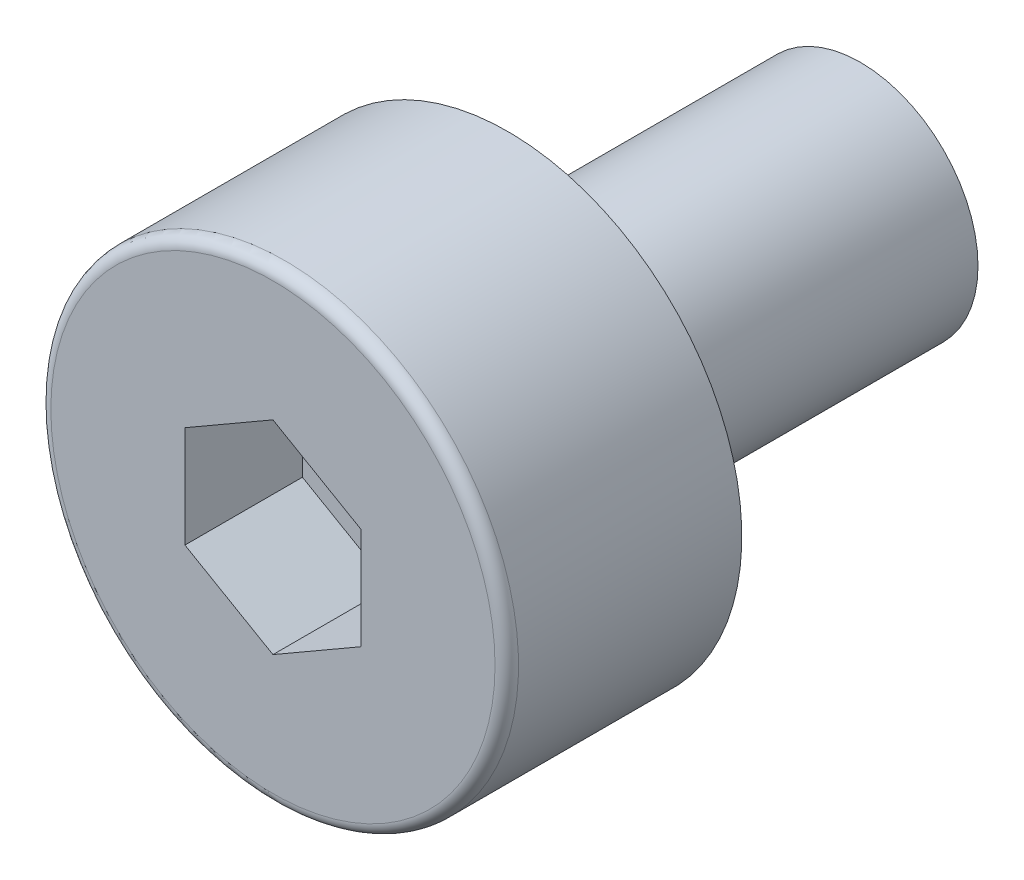
ISO-10303-21;
HEADER;
FILE_DESCRIPTION(('STEP AP214'),'2;1');
FILE_NAME('part.step','',(''),(''),'','','');
FILE_SCHEMA(('AUTOMOTIVE_DESIGN { 1 0 10303 214 1 1 1 1 }'));
ENDSEC;
DATA;
#1=APPLICATION_CONTEXT('core data for automotive mechanical design processes');
#2=APPLICATION_PROTOCOL_DEFINITION('international standard','automotive_design',2000,#1);
#3=PRODUCT_CONTEXT('',#1,'mechanical');
#4=PRODUCT('Part','Part','',(#3));
#5=PRODUCT_RELATED_PRODUCT_CATEGORY('part','',(#4));
#6=PRODUCT_DEFINITION_FORMATION('','',#4);
#7=PRODUCT_DEFINITION_CONTEXT('part definition',#1,'design');
#8=PRODUCT_DEFINITION('design','',#6,#7);
#9=PRODUCT_DEFINITION_SHAPE('','',#8);
#10=(LENGTH_UNIT() NAMED_UNIT(*) SI_UNIT(.MILLI.,.METRE.));
#11=(NAMED_UNIT(*) PLANE_ANGLE_UNIT() SI_UNIT($,.RADIAN.));
#12=(NAMED_UNIT(*) SI_UNIT($,.STERADIAN.) SOLID_ANGLE_UNIT());
#13=UNCERTAINTY_MEASURE_WITH_UNIT(LENGTH_MEASURE(1.E-05),#10,'distance_accuracy_value','');
#14=(GEOMETRIC_REPRESENTATION_CONTEXT(3) GLOBAL_UNCERTAINTY_ASSIGNED_CONTEXT((#13)) GLOBAL_UNIT_ASSIGNED_CONTEXT((#10,
#11,#12)) REPRESENTATION_CONTEXT('',''));
#15=CARTESIAN_POINT('',(0.,0.,0.));
#16=DIRECTION('',(0.,0.,1.));
#17=DIRECTION('',(1.,0.,0.));
#18=AXIS2_PLACEMENT_3D('',#15,#16,#17);
#19=CARTESIAN_POINT('',(0.,0.,1.));
#20=DIRECTION('',(0.,0.,1.));
#21=DIRECTION('',(1.,0.,0.));
#22=AXIS2_PLACEMENT_3D('',#19,#20,#21);
#23=PLANE('',#22);
#24=DIRECTION('',(-0.866025403784439,-0.5,0.));
#25=VECTOR('',#24,1.);
#26=CARTESIAN_POINT('',(0.,0.865000000000001,1.));
#27=LINE('',#26,#25);
#28=CARTESIAN_POINT('',(0.,0.865000000000001,1.));
#29=VERTEX_POINT('',#28);
#30=CARTESIAN_POINT('',(-0.749111974273539,0.4325,1.));
#31=VERTEX_POINT('',#30);
#32=EDGE_CURVE('E60',#29,#31,#27,.T.);
#33=ORIENTED_EDGE('',*,*,#32,.T.);
#34=DIRECTION('',(0.,1.,0.));
#35=VECTOR('',#34,1.);
#36=CARTESIAN_POINT('',(-0.749111974273539,0.4325,1.));
#37=LINE('',#36,#35);
#38=CARTESIAN_POINT('',(-0.749111974273539,-0.4325,1.));
#39=VERTEX_POINT('',#38);
#40=EDGE_CURVE('E62',#31,#39,#37,.F.);
#41=ORIENTED_EDGE('',*,*,#40,.T.);
#42=DIRECTION('',(0.866025403784439,-0.5,0.));
#43=VECTOR('',#42,1.);
#44=CARTESIAN_POINT('',(-0.749111974273539,-0.4325,1.));
#45=LINE('',#44,#43);
#46=CARTESIAN_POINT('',(0.,-0.865,1.));
#47=VERTEX_POINT('',#46);
#48=EDGE_CURVE('E64',#39,#47,#45,.T.);
#49=ORIENTED_EDGE('',*,*,#48,.T.);
#50=DIRECTION('',(0.866025403784438,0.5,0.));
#51=VECTOR('',#50,1.);
#52=CARTESIAN_POINT('',(0.,-0.865,1.));
#53=LINE('',#52,#51);
#54=CARTESIAN_POINT('',(0.749111974273539,-0.4325,1.));
#55=VERTEX_POINT('',#54);
#56=EDGE_CURVE('E297',#47,#55,#53,.T.);
#57=ORIENTED_EDGE('',*,*,#56,.T.);
#58=DIRECTION('',(0.,1.,0.));
#59=VECTOR('',#58,1.);
#60=CARTESIAN_POINT('',(0.749111974273539,-0.4325,1.));
#61=LINE('',#60,#59);
#62=CARTESIAN_POINT('',(0.749111974273539,0.432500000000001,1.));
#63=VERTEX_POINT('',#62);
#64=EDGE_CURVE('E292',#55,#63,#61,.T.);
#65=ORIENTED_EDGE('',*,*,#64,.T.);
#66=DIRECTION('',(-0.866025403784439,0.5,0.));
#67=VECTOR('',#66,1.);
#68=CARTESIAN_POINT('',(0.749111974273539,0.432500000000001,1.));
#69=LINE('',#68,#67);
#70=EDGE_CURVE('E287',#63,#29,#69,.T.);
#71=ORIENTED_EDGE('',*,*,#70,.T.);
#72=EDGE_LOOP('',(#33,#41,#49,#57,#65,#71));
#73=FACE_BOUND('',#72,.T.);
#74=ADVANCED_FACE('F17',(#73),#23,.T.);
#75=CARTESIAN_POINT('',(-0.749111974273539,-0.4325,1.));
#76=DIRECTION('',(-0.5,-0.866025403784439,0.));
#77=DIRECTION('',(0.866025403784439,-0.5,0.));
#78=AXIS2_PLACEMENT_3D('',#75,#76,#77);
#79=PLANE('',#78);
#80=DIRECTION('',(0.,0.,1.));
#81=VECTOR('',#80,1.);
#82=CARTESIAN_POINT('',(0.,-0.865,1.));
#83=LINE('',#82,#81);
#84=CARTESIAN_POINT('',(0.,-0.865,2.));
#85=VERTEX_POINT('',#84);
#86=EDGE_CURVE('E79',#85,#47,#83,.F.);
#87=ORIENTED_EDGE('',*,*,#86,.T.);
#88=ORIENTED_EDGE('',*,*,#48,.F.);
#89=DIRECTION('',(0.,0.,1.));
#90=VECTOR('',#89,1.);
#91=CARTESIAN_POINT('',(-0.749111974273539,-0.4325,1.));
#92=LINE('',#91,#90);
#93=CARTESIAN_POINT('',(-0.749111974273539,-0.4325,2.));
#94=VERTEX_POINT('',#93);
#95=EDGE_CURVE('E70',#39,#94,#92,.T.);
#96=ORIENTED_EDGE('',*,*,#95,.T.);
#97=DIRECTION('',(-0.866025403784439,0.5,0.));
#98=VECTOR('',#97,1.);
#99=CARTESIAN_POINT('',(0.,-0.865,2.));
#100=LINE('',#99,#98);
#101=EDGE_CURVE('E146',#85,#94,#100,.T.);
#102=ORIENTED_EDGE('',*,*,#101,.F.);
#103=EDGE_LOOP('',(#87,#88,#96,#102));
#104=FACE_BOUND('',#103,.T.);
#105=ADVANCED_FACE('F74',(#104),#79,.F.);
#106=CARTESIAN_POINT('',(-0.749111974273539,0.4325,1.));
#107=DIRECTION('',(-1.,0.,0.));
#108=DIRECTION('',(0.,0.,1.));
#109=AXIS2_PLACEMENT_3D('',#106,#107,#108);
#110=PLANE('',#109);
#111=ORIENTED_EDGE('',*,*,#95,.F.);
#112=ORIENTED_EDGE('',*,*,#40,.F.);
#113=DIRECTION('',(0.,0.,1.));
#114=VECTOR('',#113,1.);
#115=CARTESIAN_POINT('',(-0.749111974273539,0.4325,1.));
#116=LINE('',#115,#114);
#117=CARTESIAN_POINT('',(-0.749111974273539,0.4325,2.));
#118=VERTEX_POINT('',#117);
#119=EDGE_CURVE('E87',#31,#118,#116,.T.);
#120=ORIENTED_EDGE('',*,*,#119,.T.);
#121=DIRECTION('',(0.,1.,0.));
#122=VECTOR('',#121,1.);
#123=CARTESIAN_POINT('',(-0.749111974273539,0.,2.));
#124=LINE('',#123,#122);
#125=EDGE_CURVE('E84',#94,#118,#124,.T.);
#126=ORIENTED_EDGE('',*,*,#125,.F.);
#127=EDGE_LOOP('',(#111,#112,#120,#126));
#128=FACE_BOUND('',#127,.T.);
#129=ADVANCED_FACE('F82',(#128),#110,.F.);
#130=CARTESIAN_POINT('',(0.,0.865000000000001,1.));
#131=DIRECTION('',(-0.5,0.866025403784439,0.));
#132=DIRECTION('',(-0.866025403784439,-0.5,0.));
#133=AXIS2_PLACEMENT_3D('',#130,#131,#132);
#134=PLANE('',#133);
#135=ORIENTED_EDGE('',*,*,#119,.F.);
#136=ORIENTED_EDGE('',*,*,#32,.F.);
#137=DIRECTION('',(0.,0.,1.));
#138=VECTOR('',#137,1.);
#139=CARTESIAN_POINT('',(0.,0.865000000000001,1.));
#140=LINE('',#139,#138);
#141=CARTESIAN_POINT('',(0.,0.865000000000001,2.));
#142=VERTEX_POINT('',#141);
#143=EDGE_CURVE('E288',#29,#142,#140,.T.);
#144=ORIENTED_EDGE('',*,*,#143,.T.);
#145=DIRECTION('',(0.866025403784439,0.5,0.));
#146=VECTOR('',#145,1.);
#147=CARTESIAN_POINT('',(-0.749111974273539,0.4325,2.));
#148=LINE('',#147,#146);
#149=EDGE_CURVE('E142',#118,#142,#148,.T.);
#150=ORIENTED_EDGE('',*,*,#149,.F.);
#151=EDGE_LOOP('',(#135,#136,#144,#150));
#152=FACE_BOUND('',#151,.T.);
#153=ADVANCED_FACE('F225',(#152),#134,.F.);
#154=CARTESIAN_POINT('',(0.749111974273539,0.432500000000001,1.));
#155=DIRECTION('',(0.5,0.866025403784439,0.));
#156=DIRECTION('',(-0.866025403784439,0.5,0.));
#157=AXIS2_PLACEMENT_3D('',#154,#155,#156);
#158=PLANE('',#157);
#159=ORIENTED_EDGE('',*,*,#143,.F.);
#160=ORIENTED_EDGE('',*,*,#70,.F.);
#161=DIRECTION('',(0.,0.,-1.));
#162=VECTOR('',#161,1.);
#163=CARTESIAN_POINT('',(0.749111974273539,0.432500000000001,1.));
#164=LINE('',#163,#162);
#165=CARTESIAN_POINT('',(0.749111974273539,0.432500000000001,2.));
#166=VERTEX_POINT('',#165);
#167=EDGE_CURVE('E294',#63,#166,#164,.F.);
#168=ORIENTED_EDGE('',*,*,#167,.T.);
#169=DIRECTION('',(0.866025403784439,-0.5,0.));
#170=VECTOR('',#169,1.);
#171=CARTESIAN_POINT('',(0.,0.865000000000001,2.));
#172=LINE('',#171,#170);
#173=EDGE_CURVE('E139',#142,#166,#172,.T.);
#174=ORIENTED_EDGE('',*,*,#173,.F.);
#175=EDGE_LOOP('',(#159,#160,#168,#174));
#176=FACE_BOUND('',#175,.T.);
#177=ADVANCED_FACE('F217',(#176),#158,.F.);
#178=CARTESIAN_POINT('',(0.749111974273539,-0.4325,1.));
#179=DIRECTION('',(1.,0.,0.));
#180=DIRECTION('',(0.,0.,-1.));
#181=AXIS2_PLACEMENT_3D('',#178,#179,#180);
#182=PLANE('',#181);
#183=ORIENTED_EDGE('',*,*,#167,.F.);
#184=ORIENTED_EDGE('',*,*,#64,.F.);
#185=DIRECTION('',(0.,0.,1.));
#186=VECTOR('',#185,1.);
#187=CARTESIAN_POINT('',(0.749111974273539,-0.432499999999999,1.));
#188=LINE('',#187,#186);
#189=CARTESIAN_POINT('',(0.749111974273539,-0.4325,2.));
#190=VERTEX_POINT('',#189);
#191=EDGE_CURVE('E147',#55,#190,#188,.T.);
#192=ORIENTED_EDGE('',*,*,#191,.T.);
#193=DIRECTION('',(0.,1.,0.));
#194=VECTOR('',#193,1.);
#195=CARTESIAN_POINT('',(0.749111974273539,0.,2.));
#196=LINE('',#195,#194);
#197=EDGE_CURVE('E136',#166,#190,#196,.F.);
#198=ORIENTED_EDGE('',*,*,#197,.F.);
#199=EDGE_LOOP('',(#183,#184,#192,#198));
#200=FACE_BOUND('',#199,.T.);
#201=ADVANCED_FACE('F210',(#200),#182,.F.);
#202=CARTESIAN_POINT('',(0.,-0.865,1.));
#203=DIRECTION('',(0.5,-0.866025403784438,0.));
#204=DIRECTION('',(0.866025403784438,0.5,0.));
#205=AXIS2_PLACEMENT_3D('',#202,#203,#204);
#206=PLANE('',#205);
#207=ORIENTED_EDGE('',*,*,#191,.F.);
#208=ORIENTED_EDGE('',*,*,#56,.F.);
#209=ORIENTED_EDGE('',*,*,#86,.F.);
#210=DIRECTION('',(-0.866025403784438,-0.5,0.));
#211=VECTOR('',#210,1.);
#212=CARTESIAN_POINT('',(0.749111974273539,-0.4325,2.));
#213=LINE('',#212,#211);
#214=EDGE_CURVE('E97',#190,#85,#213,.T.);
#215=ORIENTED_EDGE('',*,*,#214,.F.);
#216=EDGE_LOOP('',(#207,#208,#209,#215));
#217=FACE_BOUND('',#216,.T.);
#218=ADVANCED_FACE('F203',(#217),#206,.F.);
#219=CARTESIAN_POINT('',(0.,0.,-3.));
#220=DIRECTION('',(0.,0.,-1.));
#221=DIRECTION('',(-1.,0.,0.));
#222=AXIS2_PLACEMENT_3D('',#219,#220,#221);
#223=PLANE('',#222);
#224=CARTESIAN_POINT('',(0.,0.,-3.));
#225=DIRECTION('',(0.,0.,1.));
#226=DIRECTION('',(1.,0.,0.));
#227=AXIS2_PLACEMENT_3D('',#224,#225,#226);
#228=CIRCLE('',#227,1.);
#229=CARTESIAN_POINT('',(1.,0.,-3.));
#230=VERTEX_POINT('',#229);
#231=EDGE_CURVE('E95',#230,#230,#228,.T.);
#232=ORIENTED_EDGE('',*,*,#231,.F.);
#233=EDGE_LOOP('',(#232));
#234=FACE_BOUND('',#233,.T.);
#235=ADVANCED_FACE('F122',(#234),#223,.T.);
#236=CARTESIAN_POINT('',(0.,0.,2.));
#237=DIRECTION('',(0.,0.,1.));
#238=DIRECTION('',(1.,0.,0.));
#239=AXIS2_PLACEMENT_3D('',#236,#237,#238);
#240=PLANE('',#239);
#241=ORIENTED_EDGE('',*,*,#197,.T.);
#242=ORIENTED_EDGE('',*,*,#214,.T.);
#243=ORIENTED_EDGE('',*,*,#101,.T.);
#244=ORIENTED_EDGE('',*,*,#125,.T.);
#245=ORIENTED_EDGE('',*,*,#149,.T.);
#246=ORIENTED_EDGE('',*,*,#173,.T.);
#247=EDGE_LOOP('',(#241,#242,#243,#244,#245,#246));
#248=FACE_BOUND('',#247,.T.);
#249=CARTESIAN_POINT('',(0.,0.,2.));
#250=DIRECTION('',(0.,0.,-1.));
#251=DIRECTION('',(-1.,0.,0.));
#252=AXIS2_PLACEMENT_3D('',#249,#250,#251);
#253=CIRCLE('',#252,1.89);
#254=CARTESIAN_POINT('',(-1.89,0.,2.));
#255=VERTEX_POINT('',#254);
#256=CARTESIAN_POINT('',(1.89,0.,2.));
#257=VERTEX_POINT('',#256);
#258=EDGE_CURVE('E94',#255,#257,#253,.T.);
#259=ORIENTED_EDGE('',*,*,#258,.F.);
#260=CARTESIAN_POINT('',(0.,0.,2.));
#261=DIRECTION('',(0.,0.,-1.));
#262=DIRECTION('',(1.,0.,0.));
#263=AXIS2_PLACEMENT_3D('',#260,#261,#262);
#264=CIRCLE('',#263,1.89);
#265=EDGE_CURVE('E36',#257,#255,#264,.T.);
#266=ORIENTED_EDGE('',*,*,#265,.F.);
#267=EDGE_LOOP('',(#259,#266));
#268=FACE_BOUND('',#267,.T.);
#269=ADVANCED_FACE('F103',(#248,#268),#240,.T.);
#270=CARTESIAN_POINT('',(0.,0.,-3.));
#271=DIRECTION('',(0.,0.,1.));
#272=DIRECTION('',(1.,0.,0.));
#273=AXIS2_PLACEMENT_3D('',#270,#271,#272);
#274=CYLINDRICAL_SURFACE('',#273,1.);
#275=ORIENTED_EDGE('',*,*,#231,.T.);
#276=EDGE_LOOP('',(#275));
#277=FACE_BOUND('',#276,.T.);
#278=CARTESIAN_POINT('',(0.,0.,0.));
#279=DIRECTION('',(0.,0.,1.));
#280=DIRECTION('',(1.,0.,0.));
#281=AXIS2_PLACEMENT_3D('',#278,#279,#280);
#282=CIRCLE('',#281,1.);
#283=CARTESIAN_POINT('',(1.,0.,0.));
#284=VERTEX_POINT('',#283);
#285=EDGE_CURVE('E91',#284,#284,#282,.F.);
#286=ORIENTED_EDGE('',*,*,#285,.T.);
#287=EDGE_LOOP('',(#286));
#288=FACE_BOUND('',#287,.T.);
#289=ADVANCED_FACE('F121',(#277,#288),#274,.T.);
#290=CARTESIAN_POINT('',(0.,0.,1.9));
#291=DIRECTION('',(0.,0.,1.));
#292=DIRECTION('',(1.,0.,0.));
#293=AXIS2_PLACEMENT_3D('',#290,#291,#292);
#294=TOROIDAL_SURFACE('',#293,1.89,0.1);
#295=ORIENTED_EDGE('',*,*,#265,.T.);
#296=ORIENTED_EDGE('',*,*,#258,.T.);
#297=EDGE_LOOP('',(#295,#296));
#298=FACE_BOUND('',#297,.T.);
#299=CARTESIAN_POINT('',(0.,0.,1.9));
#300=DIRECTION('',(0.,0.,-1.));
#301=DIRECTION('',(-1.,0.,0.));
#302=AXIS2_PLACEMENT_3D('',#299,#300,#301);
#303=CIRCLE('',#302,1.99);
#304=CARTESIAN_POINT('',(-1.99,0.,1.9));
#305=VERTEX_POINT('',#304);
#306=EDGE_CURVE('E28',#305,#305,#303,.T.);
#307=ORIENTED_EDGE('',*,*,#306,.F.);
#308=EDGE_LOOP('',(#307));
#309=FACE_BOUND('',#308,.T.);
#310=ADVANCED_FACE('F99',(#298,#309),#294,.T.);
#311=CARTESIAN_POINT('',(0.,0.,0.));
#312=DIRECTION('',(0.,0.,1.));
#313=DIRECTION('',(1.,0.,0.));
#314=AXIS2_PLACEMENT_3D('',#311,#312,#313);
#315=PLANE('',#314);
#316=ORIENTED_EDGE('',*,*,#285,.F.);
#317=EDGE_LOOP('',(#316));
#318=FACE_BOUND('',#317,.T.);
#319=CARTESIAN_POINT('',(0.,0.,0.));
#320=DIRECTION('',(0.,0.,-1.));
#321=DIRECTION('',(-1.,0.,0.));
#322=AXIS2_PLACEMENT_3D('',#319,#320,#321);
#323=CIRCLE('',#322,1.99);
#324=CARTESIAN_POINT('',(-1.99,0.,0.));
#325=VERTEX_POINT('',#324);
#326=EDGE_CURVE('E11',#325,#325,#323,.F.);
#327=ORIENTED_EDGE('',*,*,#326,.F.);
#328=EDGE_LOOP('',(#327));
#329=FACE_BOUND('',#328,.T.);
#330=ADVANCED_FACE('F161',(#318,#329),#315,.F.);
#331=CARTESIAN_POINT('',(0.,0.,2.));
#332=DIRECTION('',(0.,0.,-1.));
#333=DIRECTION('',(-1.,0.,0.));
#334=AXIS2_PLACEMENT_3D('',#331,#332,#333);
#335=CYLINDRICAL_SURFACE('',#334,1.99);
#336=ORIENTED_EDGE('',*,*,#326,.T.);
#337=EDGE_LOOP('',(#336));
#338=FACE_BOUND('',#337,.T.);
#339=ORIENTED_EDGE('',*,*,#306,.T.);
#340=EDGE_LOOP('',(#339));
#341=FACE_BOUND('',#340,.T.);
#342=ADVANCED_FACE('F165',(#338,#341),#335,.T.);
#343=CLOSED_SHELL('',(#74,#105,#129,#153,#177,#201,#218,#235,#269,#289,#310,#330,#342));
#344=MANIFOLD_SOLID_BREP('B1',#343);
#345=ADVANCED_BREP_SHAPE_REPRESENTATION('',(#18,#344),#14);
#346=SHAPE_DEFINITION_REPRESENTATION(#9,#345);
ENDSEC;
END-ISO-10303-21;
